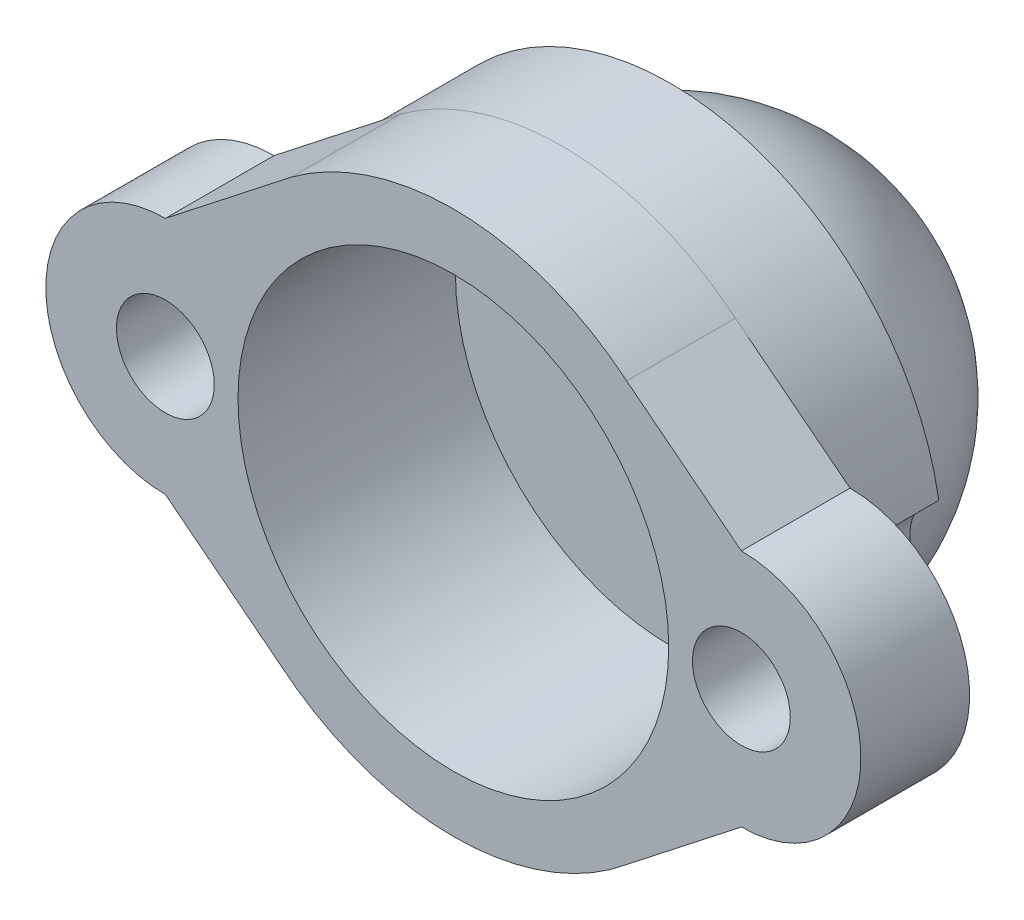
ISO-10303-21;
HEADER;
FILE_DESCRIPTION(('STEP AP214'),'2;1');
FILE_NAME('part.step','',(''),(''),'','','');
FILE_SCHEMA(('AUTOMOTIVE_DESIGN { 1 0 10303 214 1 1 1 1 }'));
ENDSEC;
DATA;
#1=APPLICATION_CONTEXT('core data for automotive mechanical design processes');
#2=APPLICATION_PROTOCOL_DEFINITION('international standard','automotive_design',2000,#1);
#3=PRODUCT_CONTEXT('',#1,'mechanical');
#4=PRODUCT('Part','Part','',(#3));
#5=PRODUCT_RELATED_PRODUCT_CATEGORY('part','',(#4));
#6=PRODUCT_DEFINITION_FORMATION('','',#4);
#7=PRODUCT_DEFINITION_CONTEXT('part definition',#1,'design');
#8=PRODUCT_DEFINITION('design','',#6,#7);
#9=PRODUCT_DEFINITION_SHAPE('','',#8);
#10=(LENGTH_UNIT() NAMED_UNIT(*) SI_UNIT(.MILLI.,.METRE.));
#11=(NAMED_UNIT(*) PLANE_ANGLE_UNIT() SI_UNIT($,.RADIAN.));
#12=(NAMED_UNIT(*) SI_UNIT($,.STERADIAN.) SOLID_ANGLE_UNIT());
#13=UNCERTAINTY_MEASURE_WITH_UNIT(LENGTH_MEASURE(1.E-05),#10,'distance_accuracy_value','');
#14=(GEOMETRIC_REPRESENTATION_CONTEXT(3) GLOBAL_UNCERTAINTY_ASSIGNED_CONTEXT((#13)) GLOBAL_UNIT_ASSIGNED_CONTEXT((#10,
#11,#12)) REPRESENTATION_CONTEXT('',''));
#15=CARTESIAN_POINT('',(0.,0.,0.));
#16=DIRECTION('',(0.,0.,1.));
#17=DIRECTION('',(1.,0.,0.));
#18=AXIS2_PLACEMENT_3D('',#15,#16,#17);
#19=CARTESIAN_POINT('',(-5.21556619172103,-6.6591934788986,2.54));
#20=DIRECTION('',(0.61660321136518,0.787274081711158,0.));
#21=DIRECTION('',(-0.787274081711158,0.61660321136518,0.));
#22=AXIS2_PLACEMENT_3D('',#19,#20,#21);
#23=PLANE('',#22);
#24=DIRECTION('',(0.787274081711159,-0.61660321136518,0.));
#25=VECTOR('',#24,1.);
#26=CARTESIAN_POINT('',(-5.21556619172103,-6.6591934788986,0.));
#27=LINE('',#26,#25);
#28=CARTESIAN_POINT('',(-5.57405324459235,-6.37842179700499,0.));
#29=VERTEX_POINT('',#28);
#30=CARTESIAN_POINT('',(-2.89267694980769,-8.47851028289685,0.));
#31=VERTEX_POINT('',#30);
#32=EDGE_CURVE('E150',#29,#31,#27,.T.);
#33=ORIENTED_EDGE('',*,*,#32,.T.);
#34=DIRECTION('',(0.,0.,-1.));
#35=VECTOR('',#34,1.);
#36=CARTESIAN_POINT('',(-2.89267694980769,-8.47851028289685,2.54));
#37=LINE('',#36,#35);
#38=CARTESIAN_POINT('',(-2.89267694980769,-8.47851028289685,2.54));
#39=VERTEX_POINT('',#38);
#40=EDGE_CURVE('E39',#39,#31,#37,.T.);
#41=ORIENTED_EDGE('',*,*,#40,.F.);
#42=DIRECTION('',(0.787274081711159,-0.61660321136518,0.));
#43=VECTOR('',#42,1.);
#44=CARTESIAN_POINT('',(-5.21556619172103,-6.6591934788986,2.54));
#45=LINE('',#44,#43);
#46=CARTESIAN_POINT('',(-5.57405324459235,-6.37842179700499,2.54));
#47=VERTEX_POINT('',#46);
#48=EDGE_CURVE('E159',#47,#39,#45,.T.);
#49=ORIENTED_EDGE('',*,*,#48,.F.);
#50=DIRECTION('',(0.,0.,-1.));
#51=VECTOR('',#50,1.);
#52=CARTESIAN_POINT('',(-5.57405324459235,-6.37842179700499,2.54));
#53=LINE('',#52,#51);
#54=EDGE_CURVE('E184',#47,#29,#53,.T.);
#55=ORIENTED_EDGE('',*,*,#54,.T.);
#56=EDGE_LOOP('',(#33,#41,#49,#55));
#57=FACE_BOUND('',#56,.T.);
#58=ADVANCED_FACE('F35',(#57),#23,.F.);
#59=CARTESIAN_POINT('',(1.15694675540765,-3.58442179700499,2.54));
#60=DIRECTION('',(0.,0.,-1.));
#61=DIRECTION('',(-1.,0.,0.));
#62=AXIS2_PLACEMENT_3D('',#59,#60,#61);
#63=CYLINDRICAL_SURFACE('',#62,6.35228732517518);
#64=CARTESIAN_POINT('',(1.15694675540765,-3.58442179700499,0.));
#65=DIRECTION('',(0.,0.,1.));
#66=DIRECTION('',(1.,0.,0.));
#67=AXIS2_PLACEMENT_3D('',#64,#65,#66);
#68=CIRCLE('',#67,6.35228732517518);
#69=CARTESIAN_POINT('',(5.20657046062299,-8.47851028289685,0.));
#70=VERTEX_POINT('',#69);
#71=EDGE_CURVE('E188',#31,#70,#68,.T.);
#72=ORIENTED_EDGE('',*,*,#71,.T.);
#73=DIRECTION('',(0.,0.,-1.));
#74=VECTOR('',#73,1.);
#75=CARTESIAN_POINT('',(5.20657046062299,-8.47851028289685,2.54));
#76=LINE('',#75,#74);
#77=CARTESIAN_POINT('',(5.20657046062299,-8.47851028289685,2.54));
#78=VERTEX_POINT('',#77);
#79=EDGE_CURVE('E221',#78,#70,#76,.T.);
#80=ORIENTED_EDGE('',*,*,#79,.F.);
#81=CARTESIAN_POINT('',(1.15694675540765,-3.58442179700499,2.54));
#82=DIRECTION('',(0.,0.,1.));
#83=DIRECTION('',(1.,0.,0.));
#84=AXIS2_PLACEMENT_3D('',#81,#82,#83);
#85=CIRCLE('',#84,6.35228732517518);
#86=EDGE_CURVE('E163',#39,#78,#85,.T.);
#87=ORIENTED_EDGE('',*,*,#86,.F.);
#88=ORIENTED_EDGE('',*,*,#40,.T.);
#89=EDGE_LOOP('',(#72,#80,#87,#88));
#90=FACE_BOUND('',#89,.T.);
#91=ADVANCED_FACE('F228',(#90),#63,.T.);
#92=CARTESIAN_POINT('',(6.09530739447928,-7.78244005753957,2.54));
#93=DIRECTION('',(0.61660321136518,-0.787274081711159,0.));
#94=DIRECTION('',(0.787274081711158,0.61660321136518,0.));
#95=AXIS2_PLACEMENT_3D('',#92,#93,#94);
#96=PLANE('',#95);
#97=DIRECTION('',(-0.787274081711158,-0.616603211365179,0.));
#98=VECTOR('',#97,1.);
#99=CARTESIAN_POINT('',(6.09530739447928,-7.78244005753957,0.));
#100=LINE('',#99,#98);
#101=CARTESIAN_POINT('',(7.88794675540765,-6.37842179700499,0.));
#102=VERTEX_POINT('',#101);
#103=EDGE_CURVE('E191',#102,#70,#100,.T.);
#104=ORIENTED_EDGE('',*,*,#103,.F.);
#105=DIRECTION('',(0.,0.,-1.));
#106=VECTOR('',#105,1.);
#107=CARTESIAN_POINT('',(7.88794675540765,-6.37842179700499,2.54));
#108=LINE('',#107,#106);
#109=CARTESIAN_POINT('',(7.88794675540765,-6.37842179700499,2.54));
#110=VERTEX_POINT('',#109);
#111=EDGE_CURVE('E220',#110,#102,#108,.T.);
#112=ORIENTED_EDGE('',*,*,#111,.F.);
#113=DIRECTION('',(-0.787274081711158,-0.616603211365179,0.));
#114=VECTOR('',#113,1.);
#115=CARTESIAN_POINT('',(6.09530739447928,-7.78244005753957,2.54));
#116=LINE('',#115,#114);
#117=EDGE_CURVE('E165',#110,#78,#116,.T.);
#118=ORIENTED_EDGE('',*,*,#117,.T.);
#119=ORIENTED_EDGE('',*,*,#79,.T.);
#120=EDGE_LOOP('',(#104,#112,#118,#119));
#121=FACE_BOUND('',#120,.T.);
#122=ADVANCED_FACE('F238',(#121),#96,.T.);
#123=CARTESIAN_POINT('',(7.88794675540765,-3.58442179700499,2.54));
#124=DIRECTION('',(0.,0.,-1.));
#125=DIRECTION('',(-1.,0.,0.));
#126=AXIS2_PLACEMENT_3D('',#123,#124,#125);
#127=CYLINDRICAL_SURFACE('',#126,2.794);
#128=CARTESIAN_POINT('',(7.88794675540765,-3.58442179700499,0.));
#129=DIRECTION('',(0.,0.,1.));
#130=DIRECTION('',(1.,0.,0.));
#131=AXIS2_PLACEMENT_3D('',#128,#129,#130);
#132=CIRCLE('',#131,2.794);
#133=CARTESIAN_POINT('',(7.88794675540765,-0.790421797004992,0.));
#134=VERTEX_POINT('',#133);
#135=EDGE_CURVE('E194',#102,#134,#132,.T.);
#136=ORIENTED_EDGE('',*,*,#135,.T.);
#137=DIRECTION('',(0.,0.,-1.));
#138=VECTOR('',#137,1.);
#139=CARTESIAN_POINT('',(7.88794675540765,-0.790421797004992,2.54));
#140=LINE('',#139,#138);
#141=CARTESIAN_POINT('',(7.88794675540765,-0.790421797004992,2.54));
#142=VERTEX_POINT('',#141);
#143=EDGE_CURVE('E217',#142,#134,#140,.T.);
#144=ORIENTED_EDGE('',*,*,#143,.F.);
#145=CARTESIAN_POINT('',(7.88794675540765,-3.58442179700499,2.54));
#146=DIRECTION('',(0.,0.,1.));
#147=DIRECTION('',(1.,0.,0.));
#148=AXIS2_PLACEMENT_3D('',#145,#146,#147);
#149=CIRCLE('',#148,2.794);
#150=EDGE_CURVE('E168',#110,#142,#149,.T.);
#151=ORIENTED_EDGE('',*,*,#150,.F.);
#152=ORIENTED_EDGE('',*,*,#111,.T.);
#153=EDGE_LOOP('',(#136,#144,#151,#152));
#154=FACE_BOUND('',#153,.T.);
#155=ADVANCED_FACE('F243',(#154),#127,.T.);
#156=CARTESIAN_POINT('',(2.61529459261675,3.33918735883311,2.54));
#157=DIRECTION('',(-0.61660321136518,-0.787274081711158,0.));
#158=DIRECTION('',(0.787274081711159,-0.61660321136518,0.));
#159=AXIS2_PLACEMENT_3D('',#156,#157,#158);
#160=PLANE('',#159);
#161=DIRECTION('',(-0.787274081711158,0.61660321136518,0.));
#162=VECTOR('',#161,1.);
#163=CARTESIAN_POINT('',(2.61529459261675,3.33918735883311,0.));
#164=LINE('',#163,#162);
#165=CARTESIAN_POINT('',(5.20657046062299,1.30966668888687,0.));
#166=VERTEX_POINT('',#165);
#167=EDGE_CURVE('E196',#134,#166,#164,.T.);
#168=ORIENTED_EDGE('',*,*,#167,.T.);
#169=DIRECTION('',(0.,0.,-1.));
#170=VECTOR('',#169,1.);
#171=CARTESIAN_POINT('',(5.20657046062299,1.30966668888687,2.54));
#172=LINE('',#171,#170);
#173=CARTESIAN_POINT('',(5.20657046062299,1.30966668888687,2.54));
#174=VERTEX_POINT('',#173);
#175=EDGE_CURVE('E214',#174,#166,#172,.T.);
#176=ORIENTED_EDGE('',*,*,#175,.F.);
#177=DIRECTION('',(-0.787274081711158,0.61660321136518,0.));
#178=VECTOR('',#177,1.);
#179=CARTESIAN_POINT('',(2.61529459261675,3.33918735883311,2.54));
#180=LINE('',#179,#178);
#181=EDGE_CURVE('E170',#142,#174,#180,.T.);
#182=ORIENTED_EDGE('',*,*,#181,.F.);
#183=ORIENTED_EDGE('',*,*,#143,.T.);
#184=EDGE_LOOP('',(#168,#176,#182,#183));
#185=FACE_BOUND('',#184,.T.);
#186=ADVANCED_FACE('F294',(#185),#160,.F.);
#187=CARTESIAN_POINT('',(1.15694675540765,-3.58442179700499,2.54));
#188=DIRECTION('',(0.,0.,-1.));
#189=DIRECTION('',(-1.,0.,0.));
#190=AXIS2_PLACEMENT_3D('',#187,#188,#189);
#191=CYLINDRICAL_SURFACE('',#190,6.35228732517518);
#192=CARTESIAN_POINT('',(1.15694675540765,-3.58442179700499,0.));
#193=DIRECTION('',(0.,0.,1.));
#194=DIRECTION('',(1.,0.,0.));
#195=AXIS2_PLACEMENT_3D('',#192,#193,#194);
#196=CIRCLE('',#195,6.35228732517518);
#197=CARTESIAN_POINT('',(-2.62429032371479,1.51987055483487,0.));
#198=VERTEX_POINT('',#197);
#199=EDGE_CURVE('E198',#166,#198,#196,.T.);
#200=ORIENTED_EDGE('',*,*,#199,.T.);
#201=DIRECTION('',(0.,0.,-1.));
#202=VECTOR('',#201,1.);
#203=CARTESIAN_POINT('',(-2.62429032371479,1.51987055483487,2.54));
#204=LINE('',#203,#202);
#205=CARTESIAN_POINT('',(-2.62429032371479,1.51987055483487,2.54));
#206=VERTEX_POINT('',#205);
#207=EDGE_CURVE('E211',#206,#198,#204,.T.);
#208=ORIENTED_EDGE('',*,*,#207,.F.);
#209=CARTESIAN_POINT('',(1.15694675540765,-3.58442179700499,2.54));
#210=DIRECTION('',(0.,0.,1.));
#211=DIRECTION('',(1.,0.,0.));
#212=AXIS2_PLACEMENT_3D('',#209,#210,#211);
#213=CIRCLE('',#212,6.35228732517518);
#214=EDGE_CURVE('E172',#174,#206,#213,.T.);
#215=ORIENTED_EDGE('',*,*,#214,.F.);
#216=ORIENTED_EDGE('',*,*,#175,.T.);
#217=EDGE_LOOP('',(#200,#208,#215,#216));
#218=FACE_BOUND('',#217,.T.);
#219=ADVANCED_FACE('F297',(#218),#191,.T.);
#220=CARTESIAN_POINT('',(-1.7355533898585,2.21594078019214,2.54));
#221=DIRECTION('',(-0.616603211365179,0.787274081711159,0.));
#222=DIRECTION('',(-0.787274081711159,-0.616603211365179,0.));
#223=AXIS2_PLACEMENT_3D('',#220,#221,#222);
#224=PLANE('',#223);
#225=DIRECTION('',(0.787274081711159,0.616603211365179,0.));
#226=VECTOR('',#225,1.);
#227=CARTESIAN_POINT('',(-1.7355533898585,2.21594078019214,0.));
#228=LINE('',#227,#226);
#229=CARTESIAN_POINT('',(-5.57405324459234,-0.790421797004991,0.));
#230=VERTEX_POINT('',#229);
#231=CARTESIAN_POINT('',(-2.75848363676124,1.41476862186087,0.));
#232=VERTEX_POINT('',#231);
#233=EDGE_CURVE('E202',#230,#232,#228,.T.);
#234=ORIENTED_EDGE('',*,*,#233,.F.);
#235=DIRECTION('',(0.,0.,-1.));
#236=VECTOR('',#235,1.);
#237=CARTESIAN_POINT('',(-5.57405324459234,-0.790421797004991,2.54));
#238=LINE('',#237,#236);
#239=CARTESIAN_POINT('',(-5.57405324459234,-0.790421797004991,2.54));
#240=VERTEX_POINT('',#239);
#241=EDGE_CURVE('E209',#240,#230,#238,.T.);
#242=ORIENTED_EDGE('',*,*,#241,.F.);
#243=DIRECTION('',(0.787274081711159,0.616603211365179,0.));
#244=VECTOR('',#243,1.);
#245=CARTESIAN_POINT('',(-1.7355533898585,2.21594078019214,2.54));
#246=LINE('',#245,#244);
#247=EDGE_CURVE('E174',#240,#206,#246,.T.);
#248=ORIENTED_EDGE('',*,*,#247,.T.);
#249=ORIENTED_EDGE('',*,*,#207,.T.);
#250=EDGE_CURVE('E201',#232,#198,#228,.T.);
#251=ORIENTED_EDGE('',*,*,#250,.F.);
#252=EDGE_LOOP('',(#234,#242,#248,#249,#251));
#253=FACE_BOUND('',#252,.T.);
#254=ADVANCED_FACE('F253',(#253),#224,.T.);
#255=CARTESIAN_POINT('',(-5.57405324459235,-3.58442179700499,2.54));
#256=DIRECTION('',(0.,0.,-1.));
#257=DIRECTION('',(-1.,0.,0.));
#258=AXIS2_PLACEMENT_3D('',#255,#256,#257);
#259=CYLINDRICAL_SURFACE('',#258,1.143);
#260=CARTESIAN_POINT('',(-5.57405324459235,-3.58442179700499,2.54));
#261=DIRECTION('',(0.,0.,1.));
#262=DIRECTION('',(1.,0.,0.));
#263=AXIS2_PLACEMENT_3D('',#260,#261,#262);
#264=CIRCLE('',#263,1.143);
#265=CARTESIAN_POINT('',(-4.43105324459235,-3.58442179700499,2.54));
#266=VERTEX_POINT('',#265);
#267=EDGE_CURVE('E179',#266,#266,#264,.T.);
#268=ORIENTED_EDGE('',*,*,#267,.T.);
#269=EDGE_LOOP('',(#268));
#270=FACE_BOUND('',#269,.T.);
#271=CARTESIAN_POINT('',(-5.57405324459235,-3.58442179700499,0.));
#272=DIRECTION('',(0.,0.,1.));
#273=DIRECTION('',(1.,0.,0.));
#274=AXIS2_PLACEMENT_3D('',#271,#272,#273);
#275=CIRCLE('',#274,1.143);
#276=CARTESIAN_POINT('',(-5.10678909364895,-2.54129514446315,0.));
#277=VERTEX_POINT('',#276);
#278=CARTESIAN_POINT('',(-5.10678909364895,-4.62754844954683,0.));
#279=VERTEX_POINT('',#278);
#280=EDGE_CURVE('E160',#277,#279,#275,.T.);
#281=ORIENTED_EDGE('',*,*,#280,.F.);
#282=DIRECTION('',(0.,0.,1.));
#283=VECTOR('',#282,1.);
#284=CARTESIAN_POINT('',(-5.10678909364895,-2.54129514446315,-2.54));
#285=LINE('',#284,#283);
#286=CARTESIAN_POINT('',(-5.10678909364895,-2.54129514446315,-2.54));
#287=VERTEX_POINT('',#286);
#288=EDGE_CURVE('E152',#287,#277,#285,.T.);
#289=ORIENTED_EDGE('',*,*,#288,.F.);
#290=CARTESIAN_POINT('',(-5.57405324459235,-3.58442179700499,-2.54));
#291=DIRECTION('',(0.,0.,1.));
#292=DIRECTION('',(-1.,0.,0.));
#293=AXIS2_PLACEMENT_3D('',#290,#291,#292);
#294=CIRCLE('',#293,1.143);
#295=CARTESIAN_POINT('',(-5.10678909364895,-4.62754844954683,-2.54));
#296=VERTEX_POINT('',#295);
#297=EDGE_CURVE('E136',#296,#287,#294,.T.);
#298=ORIENTED_EDGE('',*,*,#297,.F.);
#299=DIRECTION('',(0.,0.,1.));
#300=VECTOR('',#299,1.);
#301=CARTESIAN_POINT('',(-5.10678909364895,-4.62754844954683,-2.54));
#302=LINE('',#301,#300);
#303=EDGE_CURVE('E133',#296,#279,#302,.T.);
#304=ORIENTED_EDGE('',*,*,#303,.T.);
#305=EDGE_LOOP('',(#281,#289,#298,#304));
#306=FACE_BOUND('',#305,.T.);
#307=ADVANCED_FACE('F304',(#270,#306),#259,.F.);
#308=CARTESIAN_POINT('',(-5.57405324459235,-3.58442179700499,2.54));
#309=DIRECTION('',(0.,0.,-1.));
#310=DIRECTION('',(-1.,0.,0.));
#311=AXIS2_PLACEMENT_3D('',#308,#309,#310);
#312=CYLINDRICAL_SURFACE('',#311,2.794);
#313=CARTESIAN_POINT('',(-5.57405324459235,-3.58442179700499,0.));
#314=DIRECTION('',(0.,0.,1.));
#315=DIRECTION('',(1.,0.,0.));
#316=AXIS2_PLACEMENT_3D('',#313,#314,#315);
#317=CIRCLE('',#316,2.794);
#318=EDGE_CURVE('E204',#230,#29,#317,.T.);
#319=ORIENTED_EDGE('',*,*,#318,.T.);
#320=ORIENTED_EDGE('',*,*,#54,.F.);
#321=CARTESIAN_POINT('',(-5.57405324459235,-3.58442179700499,2.54));
#322=DIRECTION('',(0.,0.,1.));
#323=DIRECTION('',(1.,0.,0.));
#324=AXIS2_PLACEMENT_3D('',#321,#322,#323);
#325=CIRCLE('',#324,2.794);
#326=EDGE_CURVE('E177',#240,#47,#325,.T.);
#327=ORIENTED_EDGE('',*,*,#326,.F.);
#328=ORIENTED_EDGE('',*,*,#241,.T.);
#329=EDGE_LOOP('',(#319,#320,#327,#328));
#330=FACE_BOUND('',#329,.T.);
#331=ADVANCED_FACE('F251',(#330),#312,.T.);
#332=CARTESIAN_POINT('',(7.88794675540765,-3.58442179700499,2.54));
#333=DIRECTION('',(0.,0.,-1.));
#334=DIRECTION('',(-1.,0.,0.));
#335=AXIS2_PLACEMENT_3D('',#332,#333,#334);
#336=CYLINDRICAL_SURFACE('',#335,1.143);
#337=CARTESIAN_POINT('',(7.88794675540765,-3.58442179700499,2.54));
#338=DIRECTION('',(0.,0.,1.));
#339=DIRECTION('',(1.,0.,0.));
#340=AXIS2_PLACEMENT_3D('',#337,#338,#339);
#341=CIRCLE('',#340,1.143);
#342=CARTESIAN_POINT('',(9.03094675540765,-3.58442179700499,2.54));
#343=VERTEX_POINT('',#342);
#344=EDGE_CURVE('E156',#343,#343,#341,.T.);
#345=ORIENTED_EDGE('',*,*,#344,.T.);
#346=EDGE_LOOP('',(#345));
#347=FACE_BOUND('',#346,.T.);
#348=CARTESIAN_POINT('',(7.88794675540765,-3.58442179700499,0.));
#349=DIRECTION('',(0.,0.,1.));
#350=DIRECTION('',(1.,0.,0.));
#351=AXIS2_PLACEMENT_3D('',#348,#349,#350);
#352=CIRCLE('',#351,1.143);
#353=CARTESIAN_POINT('',(7.42068260446426,-4.62754844954683,0.));
#354=VERTEX_POINT('',#353);
#355=CARTESIAN_POINT('',(7.42068260446426,-2.54129514446315,0.));
#356=VERTEX_POINT('',#355);
#357=EDGE_CURVE('E148',#354,#356,#352,.T.);
#358=ORIENTED_EDGE('',*,*,#357,.F.);
#359=DIRECTION('',(0.,0.,1.));
#360=VECTOR('',#359,1.);
#361=CARTESIAN_POINT('',(7.42068260446426,-4.62754844954683,-2.54));
#362=LINE('',#361,#360);
#363=CARTESIAN_POINT('',(7.42068260446426,-4.62754844954683,-2.54));
#364=VERTEX_POINT('',#363);
#365=EDGE_CURVE('E131',#364,#354,#362,.T.);
#366=ORIENTED_EDGE('',*,*,#365,.F.);
#367=CARTESIAN_POINT('',(7.88794675540765,-3.58442179700499,-2.54));
#368=DIRECTION('',(0.,0.,1.));
#369=DIRECTION('',(-1.,0.,0.));
#370=AXIS2_PLACEMENT_3D('',#367,#368,#369);
#371=CIRCLE('',#370,1.143);
#372=CARTESIAN_POINT('',(7.42068260446426,-2.54129514446315,-2.54));
#373=VERTEX_POINT('',#372);
#374=EDGE_CURVE('E137',#373,#364,#371,.T.);
#375=ORIENTED_EDGE('',*,*,#374,.F.);
#376=DIRECTION('',(0.,0.,1.));
#377=VECTOR('',#376,1.);
#378=CARTESIAN_POINT('',(7.42068260446426,-2.54129514446315,-2.54));
#379=LINE('',#378,#377);
#380=EDGE_CURVE('E263',#373,#356,#379,.T.);
#381=ORIENTED_EDGE('',*,*,#380,.T.);
#382=EDGE_LOOP('',(#358,#366,#375,#381));
#383=FACE_BOUND('',#382,.T.);
#384=ADVANCED_FACE('F37',(#347,#383),#336,.F.);
#385=CARTESIAN_POINT('',(1.15694675540765,-3.58442179700499,2.54));
#386=DIRECTION('',(0.,0.,-1.));
#387=DIRECTION('',(-1.,0.,0.));
#388=AXIS2_PLACEMENT_3D('',#385,#386,#387);
#389=CYLINDRICAL_SURFACE('',#388,5.0330227);
#390=CARTESIAN_POINT('',(1.15694675540765,-3.58442179700499,2.54));
#391=DIRECTION('',(0.,0.,1.));
#392=DIRECTION('',(1.,0.,0.));
#393=AXIS2_PLACEMENT_3D('',#390,#391,#392);
#394=CIRCLE('',#393,5.0330227);
#395=CARTESIAN_POINT('',(6.18996945540765,-3.58442179700499,2.54));
#396=VERTEX_POINT('',#395);
#397=EDGE_CURVE('E182',#396,#396,#394,.T.);
#398=ORIENTED_EDGE('',*,*,#397,.T.);
#399=EDGE_LOOP('',(#398));
#400=FACE_BOUND('',#399,.T.);
#401=CARTESIAN_POINT('',(1.15694675540765,-3.58442179700499,-2.54));
#402=DIRECTION('',(0.,0.,-1.));
#403=DIRECTION('',(-1.,0.,0.));
#404=AXIS2_PLACEMENT_3D('',#401,#402,#403);
#405=CIRCLE('',#404,5.0330227);
#406=CARTESIAN_POINT('',(-3.87607594459235,-3.58442179700499,-2.54));
#407=VERTEX_POINT('',#406);
#408=EDGE_CURVE('E259',#407,#407,#405,.T.);
#409=ORIENTED_EDGE('',*,*,#408,.T.);
#410=EDGE_LOOP('',(#409));
#411=FACE_BOUND('',#410,.T.);
#412=ADVANCED_FACE('F310',(#400,#411),#389,.F.);
#413=CARTESIAN_POINT('',(0.,0.,2.54));
#414=DIRECTION('',(0.,0.,1.));
#415=DIRECTION('',(1.,0.,0.));
#416=AXIS2_PLACEMENT_3D('',#413,#414,#415);
#417=PLANE('',#416);
#418=ORIENTED_EDGE('',*,*,#344,.F.);
#419=EDGE_LOOP('',(#418));
#420=FACE_BOUND('',#419,.T.);
#421=ORIENTED_EDGE('',*,*,#48,.T.);
#422=ORIENTED_EDGE('',*,*,#86,.T.);
#423=ORIENTED_EDGE('',*,*,#117,.F.);
#424=ORIENTED_EDGE('',*,*,#150,.T.);
#425=ORIENTED_EDGE('',*,*,#181,.T.);
#426=ORIENTED_EDGE('',*,*,#214,.T.);
#427=ORIENTED_EDGE('',*,*,#247,.F.);
#428=ORIENTED_EDGE('',*,*,#326,.T.);
#429=EDGE_LOOP('',(#421,#422,#423,#424,#425,#426,#427,#428));
#430=FACE_BOUND('',#429,.T.);
#431=ORIENTED_EDGE('',*,*,#267,.F.);
#432=EDGE_LOOP('',(#431));
#433=FACE_BOUND('',#432,.T.);
#434=ORIENTED_EDGE('',*,*,#397,.F.);
#435=EDGE_LOOP('',(#434));
#436=FACE_BOUND('',#435,.T.);
#437=ADVANCED_FACE('F246',(#420,#430,#433,#436),#417,.T.);
#438=CARTESIAN_POINT('',(0.,0.,0.));
#439=DIRECTION('',(0.,0.,1.));
#440=DIRECTION('',(1.,0.,0.));
#441=AXIS2_PLACEMENT_3D('',#438,#439,#440);
#442=PLANE('',#441);
#443=CARTESIAN_POINT('',(1.15694675540765,-3.58442179700499,0.));
#444=DIRECTION('',(0.,0.,-1.));
#445=DIRECTION('',(-1.,0.,0.));
#446=AXIS2_PLACEMENT_3D('',#443,#444,#445);
#447=CIRCLE('',#446,6.35);
#448=EDGE_CURVE('E45',#277,#232,#447,.T.);
#449=ORIENTED_EDGE('',*,*,#448,.F.);
#450=ORIENTED_EDGE('',*,*,#280,.T.);
#451=CARTESIAN_POINT('',(1.15694675540765,-3.58442179700499,0.));
#452=DIRECTION('',(0.,0.,-1.));
#453=DIRECTION('',(-1.,0.,0.));
#454=AXIS2_PLACEMENT_3D('',#451,#452,#453);
#455=CIRCLE('',#454,6.35);
#456=EDGE_CURVE('E258',#354,#279,#455,.T.);
#457=ORIENTED_EDGE('',*,*,#456,.F.);
#458=ORIENTED_EDGE('',*,*,#357,.T.);
#459=EDGE_CURVE('E11',#232,#356,#447,.T.);
#460=ORIENTED_EDGE('',*,*,#459,.F.);
#461=ORIENTED_EDGE('',*,*,#250,.T.);
#462=ORIENTED_EDGE('',*,*,#199,.F.);
#463=ORIENTED_EDGE('',*,*,#167,.F.);
#464=ORIENTED_EDGE('',*,*,#135,.F.);
#465=ORIENTED_EDGE('',*,*,#103,.T.);
#466=ORIENTED_EDGE('',*,*,#71,.F.);
#467=ORIENTED_EDGE('',*,*,#32,.F.);
#468=ORIENTED_EDGE('',*,*,#318,.F.);
#469=ORIENTED_EDGE('',*,*,#233,.T.);
#470=EDGE_LOOP('',(#449,#450,#457,#458,#460,#461,#462,#463,#464,#465,#466,#467,#468,#469));
#471=FACE_BOUND('',#470,.T.);
#472=ADVANCED_FACE('F234',(#471),#442,.F.);
#473=CARTESIAN_POINT('',(4.52244675540765,-3.58442179700499,-2.54));
#474=DIRECTION('',(0.,0.,-1.));
#475=DIRECTION('',(-1.,0.,0.));
#476=AXIS2_PLACEMENT_3D('',#473,#474,#475);
#477=PLANE('',#476);
#478=CARTESIAN_POINT('',(1.15694675540765,-3.58442179700499,-2.54));
#479=DIRECTION('',(0.,0.,1.));
#480=DIRECTION('',(1.,0.,0.));
#481=AXIS2_PLACEMENT_3D('',#478,#479,#480);
#482=CIRCLE('',#481,5.08);
#483=CARTESIAN_POINT('',(6.23694675540765,-3.58442179700499,-2.54));
#484=VERTEX_POINT('',#483);
#485=EDGE_CURVE('E268',#484,#484,#482,.T.);
#486=ORIENTED_EDGE('',*,*,#485,.T.);
#487=EDGE_LOOP('',(#486));
#488=FACE_BOUND('',#487,.T.);
#489=ORIENTED_EDGE('',*,*,#374,.T.);
#490=CARTESIAN_POINT('',(1.15694675540765,-3.58442179700499,-2.54));
#491=DIRECTION('',(0.,0.,-1.));
#492=DIRECTION('',(-1.,0.,0.));
#493=AXIS2_PLACEMENT_3D('',#490,#491,#492);
#494=CIRCLE('',#493,6.35);
#495=EDGE_CURVE('E126',#364,#296,#494,.T.);
#496=ORIENTED_EDGE('',*,*,#495,.T.);
#497=ORIENTED_EDGE('',*,*,#297,.T.);
#498=CARTESIAN_POINT('',(1.15694675540765,-3.58442179700499,-2.54));
#499=DIRECTION('',(0.,0.,-1.));
#500=DIRECTION('',(-1.,0.,0.));
#501=AXIS2_PLACEMENT_3D('',#498,#499,#500);
#502=CIRCLE('',#501,6.35);
#503=EDGE_CURVE('E142',#287,#373,#502,.T.);
#504=ORIENTED_EDGE('',*,*,#503,.T.);
#505=EDGE_LOOP('',(#489,#496,#497,#504));
#506=FACE_BOUND('',#505,.T.);
#507=ADVANCED_FACE('F140',(#488,#506),#477,.T.);
#508=CARTESIAN_POINT('',(1.15694675540765,-3.58442179700499,-2.54));
#509=DIRECTION('',(0.,0.,1.));
#510=DIRECTION('',(1.,0.,0.));
#511=AXIS2_PLACEMENT_3D('',#508,#509,#510);
#512=CYLINDRICAL_SURFACE('',#511,6.35);
#513=ORIENTED_EDGE('',*,*,#456,.T.);
#514=ORIENTED_EDGE('',*,*,#303,.F.);
#515=ORIENTED_EDGE('',*,*,#495,.F.);
#516=ORIENTED_EDGE('',*,*,#365,.T.);
#517=EDGE_LOOP('',(#513,#514,#515,#516));
#518=FACE_BOUND('',#517,.T.);
#519=ADVANCED_FACE('F129',(#518),#512,.T.);
#520=CARTESIAN_POINT('',(1.15694675540765,-3.58442179700499,-2.54));
#521=DIRECTION('',(0.,0.,1.));
#522=DIRECTION('',(1.,0.,0.));
#523=AXIS2_PLACEMENT_3D('',#520,#521,#522);
#524=CYLINDRICAL_SURFACE('',#523,6.35);
#525=ORIENTED_EDGE('',*,*,#448,.T.);
#526=ORIENTED_EDGE('',*,*,#459,.T.);
#527=ORIENTED_EDGE('',*,*,#380,.F.);
#528=ORIENTED_EDGE('',*,*,#503,.F.);
#529=ORIENTED_EDGE('',*,*,#288,.T.);
#530=EDGE_LOOP('',(#525,#526,#527,#528,#529));
#531=FACE_BOUND('',#530,.T.);
#532=ADVANCED_FACE('F256',(#531),#524,.T.);
#533=CARTESIAN_POINT('',(1.15694675540765,-3.58442179700499,-2.54));
#534=DIRECTION('',(0.,0.,1.));
#535=DIRECTION('',(0.,1.,0.));
#536=AXIS2_PLACEMENT_3D('',#533,#534,#535);
#537=SPHERICAL_SURFACE('',#536,5.08);
#538=ORIENTED_EDGE('',*,*,#485,.F.);
#539=EDGE_LOOP('',(#538));
#540=FACE_BOUND('',#539,.T.);
#541=ADVANCED_FACE('F273',(#540),#537,.T.);
#542=CARTESIAN_POINT('',(1.15694675540765,-3.58442179700499,-2.54));
#543=DIRECTION('',(0.,0.,-1.));
#544=DIRECTION('',(-1.,0.,0.));
#545=AXIS2_PLACEMENT_3D('',#542,#543,#544);
#546=PLANE('',#545);
#547=ORIENTED_EDGE('',*,*,#408,.F.);
#548=EDGE_LOOP('',(#547));
#549=FACE_BOUND('',#548,.T.);
#550=ADVANCED_FACE('F275',(#549),#546,.F.);
#551=CLOSED_SHELL('',(#58,#91,#122,#155,#186,#219,#254,#307,#331,#384,#412,#437,#472,#507,#519,
#532,#541,#550));
#552=MANIFOLD_SOLID_BREP('B2',#551);
#553=ADVANCED_BREP_SHAPE_REPRESENTATION('',(#18,#552),#14);
#554=SHAPE_DEFINITION_REPRESENTATION(#9,#553);
ENDSEC;
END-ISO-10303-21;
